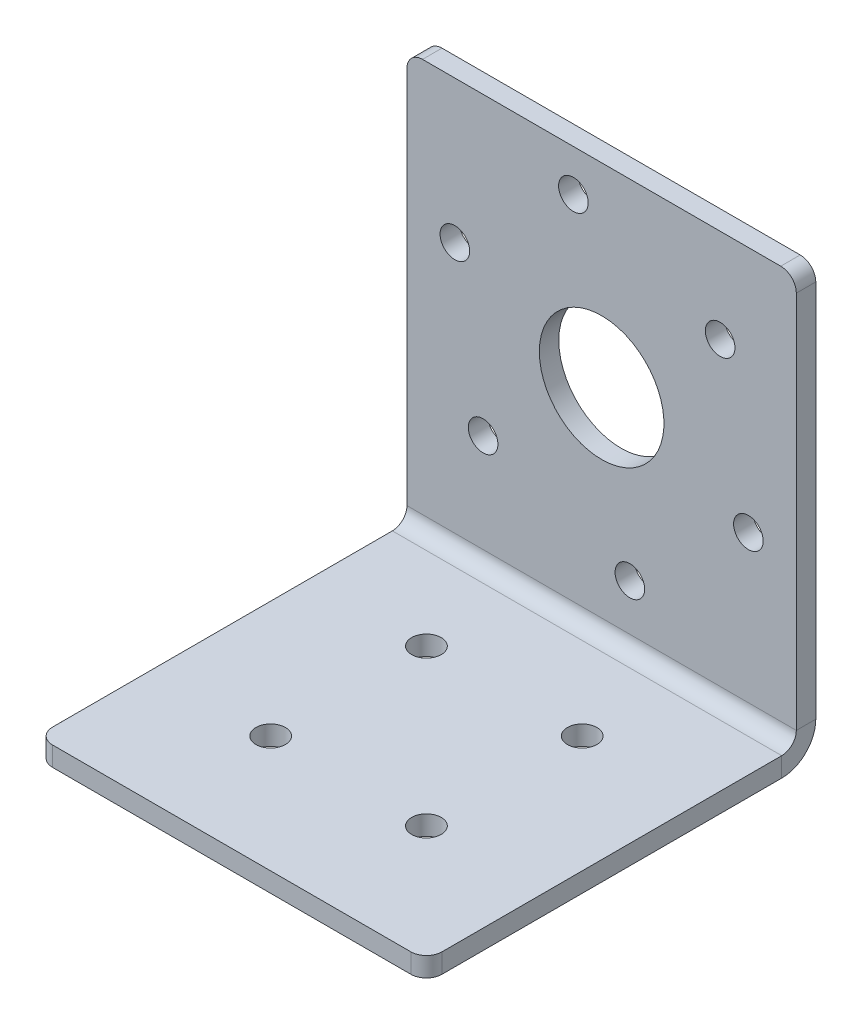
ISO-10303-21;
HEADER;
FILE_DESCRIPTION(('STEP AP214'),'2;1');
FILE_NAME('part.step','',(''),(''),'','','');
FILE_SCHEMA(('AUTOMOTIVE_DESIGN { 1 0 10303 214 1 1 1 1 }'));
ENDSEC;
DATA;
#1=APPLICATION_CONTEXT('core data for automotive mechanical design processes');
#2=APPLICATION_PROTOCOL_DEFINITION('international standard','automotive_design',2000,#1);
#3=PRODUCT_CONTEXT('',#1,'mechanical');
#4=PRODUCT('Part','Part','',(#3));
#5=PRODUCT_RELATED_PRODUCT_CATEGORY('part','',(#4));
#6=PRODUCT_DEFINITION_FORMATION('','',#4);
#7=PRODUCT_DEFINITION_CONTEXT('part definition',#1,'design');
#8=PRODUCT_DEFINITION('design','',#6,#7);
#9=PRODUCT_DEFINITION_SHAPE('','',#8);
#10=(LENGTH_UNIT() NAMED_UNIT(*) SI_UNIT(.MILLI.,.METRE.));
#11=(NAMED_UNIT(*) PLANE_ANGLE_UNIT() SI_UNIT($,.RADIAN.));
#12=(NAMED_UNIT(*) SI_UNIT($,.STERADIAN.) SOLID_ANGLE_UNIT());
#13=UNCERTAINTY_MEASURE_WITH_UNIT(LENGTH_MEASURE(1.E-05),#10,'distance_accuracy_value','');
#14=(GEOMETRIC_REPRESENTATION_CONTEXT(3) GLOBAL_UNCERTAINTY_ASSIGNED_CONTEXT((#13)) GLOBAL_UNIT_ASSIGNED_CONTEXT((#10,
#11,#12)) REPRESENTATION_CONTEXT('',''));
#15=CARTESIAN_POINT('',(0.,0.,0.));
#16=DIRECTION('',(0.,0.,1.));
#17=DIRECTION('',(1.,0.,0.));
#18=AXIS2_PLACEMENT_3D('',#15,#16,#17);
#19=CARTESIAN_POINT('',(63.5,69.85,-60.325));
#20=DIRECTION('',(1.,0.,0.));
#21=DIRECTION('',(0.,-1.,0.));
#22=AXIS2_PLACEMENT_3D('',#19,#20,#21);
#23=PLANE('',#22);
#24=DIRECTION('',(0.,0.,1.));
#25=VECTOR('',#24,1.);
#26=CARTESIAN_POINT('',(63.5,5.555000066,-60.325));
#27=LINE('',#26,#25);
#28=CARTESIAN_POINT('',(63.5,5.555000066,-63.5));
#29=VERTEX_POINT('',#28);
#30=CARTESIAN_POINT('',(63.5,5.555000066,-60.325));
#31=VERTEX_POINT('',#30);
#32=EDGE_CURVE('E12',#29,#31,#27,.T.);
#33=ORIENTED_EDGE('',*,*,#32,.F.);
#34=DIRECTION('',(0.,1.,0.));
#35=VECTOR('',#34,1.);
#36=CARTESIAN_POINT('',(63.5,69.85,-63.5));
#37=LINE('',#36,#35);
#38=CARTESIAN_POINT('',(63.5,67.31,-63.5));
#39=VERTEX_POINT('',#38);
#40=EDGE_CURVE('E112',#39,#29,#37,.F.);
#41=ORIENTED_EDGE('',*,*,#40,.F.);
#42=DIRECTION('',(0.,0.,1.));
#43=VECTOR('',#42,1.);
#44=CARTESIAN_POINT('',(63.5,67.31,-60.325));
#45=LINE('',#44,#43);
#46=CARTESIAN_POINT('',(63.5,67.31,-60.325));
#47=VERTEX_POINT('',#46);
#48=EDGE_CURVE('E61',#39,#47,#45,.T.);
#49=ORIENTED_EDGE('',*,*,#48,.T.);
#50=DIRECTION('',(0.,-1.,0.));
#51=VECTOR('',#50,1.);
#52=CARTESIAN_POINT('',(63.5,69.85,-60.325));
#53=LINE('',#52,#51);
#54=EDGE_CURVE('E115',#47,#31,#53,.T.);
#55=ORIENTED_EDGE('',*,*,#54,.T.);
#56=EDGE_LOOP('',(#33,#41,#49,#55));
#57=FACE_BOUND('',#56,.T.);
#58=ADVANCED_FACE('F51',(#57),#23,.T.);
#59=CARTESIAN_POINT('',(60.96,67.31,-60.325));
#60=DIRECTION('',(0.,0.,-1.));
#61=DIRECTION('',(-1.,0.,0.));
#62=AXIS2_PLACEMENT_3D('',#59,#60,#61);
#63=CYLINDRICAL_SURFACE('',#62,2.54);
#64=ORIENTED_EDGE('',*,*,#48,.F.);
#65=CARTESIAN_POINT('',(60.96,67.31,-63.5));
#66=DIRECTION('',(0.,0.,-1.));
#67=DIRECTION('',(-1.,0.,0.));
#68=AXIS2_PLACEMENT_3D('',#65,#66,#67);
#69=CIRCLE('',#68,2.54);
#70=CARTESIAN_POINT('',(60.96,69.85,-63.5));
#71=VERTEX_POINT('',#70);
#72=EDGE_CURVE('E140',#39,#71,#69,.F.);
#73=ORIENTED_EDGE('',*,*,#72,.T.);
#74=DIRECTION('',(0.,0.,1.));
#75=VECTOR('',#74,1.);
#76=CARTESIAN_POINT('',(60.96,69.85,-60.325));
#77=LINE('',#76,#75);
#78=CARTESIAN_POINT('',(60.96,69.85,-60.325));
#79=VERTEX_POINT('',#78);
#80=EDGE_CURVE('E192',#71,#79,#77,.T.);
#81=ORIENTED_EDGE('',*,*,#80,.T.);
#82=CARTESIAN_POINT('',(60.96,67.31,-60.325));
#83=DIRECTION('',(0.,0.,-1.));
#84=DIRECTION('',(-1.,0.,0.));
#85=AXIS2_PLACEMENT_3D('',#82,#83,#84);
#86=CIRCLE('',#85,2.54);
#87=EDGE_CURVE('E205',#47,#79,#86,.F.);
#88=ORIENTED_EDGE('',*,*,#87,.F.);
#89=EDGE_LOOP('',(#64,#73,#81,#88));
#90=FACE_BOUND('',#89,.T.);
#91=ADVANCED_FACE('F211',(#90),#63,.T.);
#92=CARTESIAN_POINT('',(0.,69.85,-60.325));
#93=DIRECTION('',(0.,1.,0.));
#94=DIRECTION('',(1.,0.,0.));
#95=AXIS2_PLACEMENT_3D('',#92,#93,#94);
#96=PLANE('',#95);
#97=ORIENTED_EDGE('',*,*,#80,.F.);
#98=DIRECTION('',(-1.,0.,0.));
#99=VECTOR('',#98,1.);
#100=CARTESIAN_POINT('',(0.,69.85,-63.5));
#101=LINE('',#100,#99);
#102=CARTESIAN_POINT('',(2.54,69.85,-63.5));
#103=VERTEX_POINT('',#102);
#104=EDGE_CURVE('E290',#103,#71,#101,.F.);
#105=ORIENTED_EDGE('',*,*,#104,.F.);
#106=DIRECTION('',(0.,0.,1.));
#107=VECTOR('',#106,1.);
#108=CARTESIAN_POINT('',(2.54,69.85,-60.325));
#109=LINE('',#108,#107);
#110=CARTESIAN_POINT('',(2.54,69.85,-60.325));
#111=VERTEX_POINT('',#110);
#112=EDGE_CURVE('E189',#103,#111,#109,.T.);
#113=ORIENTED_EDGE('',*,*,#112,.T.);
#114=DIRECTION('',(1.,0.,0.));
#115=VECTOR('',#114,1.);
#116=CARTESIAN_POINT('',(0.,69.85,-60.325));
#117=LINE('',#116,#115);
#118=EDGE_CURVE('E212',#111,#79,#117,.T.);
#119=ORIENTED_EDGE('',*,*,#118,.T.);
#120=EDGE_LOOP('',(#97,#105,#113,#119));
#121=FACE_BOUND('',#120,.T.);
#122=ADVANCED_FACE('F294',(#121),#96,.T.);
#123=CARTESIAN_POINT('',(2.54,67.31,-60.325));
#124=DIRECTION('',(0.,0.,-1.));
#125=DIRECTION('',(-1.,0.,0.));
#126=AXIS2_PLACEMENT_3D('',#123,#124,#125);
#127=CYLINDRICAL_SURFACE('',#126,2.54);
#128=ORIENTED_EDGE('',*,*,#112,.F.);
#129=CARTESIAN_POINT('',(2.54,67.31,-63.5));
#130=DIRECTION('',(0.,0.,-1.));
#131=DIRECTION('',(-1.,0.,0.));
#132=AXIS2_PLACEMENT_3D('',#129,#130,#131);
#133=CIRCLE('',#132,2.54);
#134=CARTESIAN_POINT('',(0.,67.31,-63.5));
#135=VERTEX_POINT('',#134);
#136=EDGE_CURVE('E287',#103,#135,#133,.F.);
#137=ORIENTED_EDGE('',*,*,#136,.T.);
#138=DIRECTION('',(0.,0.,1.));
#139=VECTOR('',#138,1.);
#140=CARTESIAN_POINT('',(0.,67.31,-60.325));
#141=LINE('',#140,#139);
#142=CARTESIAN_POINT('',(0.,67.31,-60.325));
#143=VERTEX_POINT('',#142);
#144=EDGE_CURVE('E186',#135,#143,#141,.T.);
#145=ORIENTED_EDGE('',*,*,#144,.T.);
#146=CARTESIAN_POINT('',(2.54,67.31,-60.325));
#147=DIRECTION('',(0.,0.,-1.));
#148=DIRECTION('',(-1.,0.,0.));
#149=AXIS2_PLACEMENT_3D('',#146,#147,#148);
#150=CIRCLE('',#149,2.54);
#151=EDGE_CURVE('E214',#111,#143,#150,.F.);
#152=ORIENTED_EDGE('',*,*,#151,.F.);
#153=EDGE_LOOP('',(#128,#137,#145,#152));
#154=FACE_BOUND('',#153,.T.);
#155=ADVANCED_FACE('F302',(#154),#127,.T.);
#156=CARTESIAN_POINT('',(0.,69.85,-60.325));
#157=DIRECTION('',(1.,0.,0.));
#158=DIRECTION('',(0.,-1.,0.));
#159=AXIS2_PLACEMENT_3D('',#156,#157,#158);
#160=PLANE('',#159);
#161=ORIENTED_EDGE('',*,*,#144,.F.);
#162=DIRECTION('',(0.,1.,0.));
#163=VECTOR('',#162,1.);
#164=CARTESIAN_POINT('',(0.,69.85,-63.5));
#165=LINE('',#164,#163);
#166=CARTESIAN_POINT('',(0.,5.555000066,-63.5));
#167=VERTEX_POINT('',#166);
#168=EDGE_CURVE('E264',#135,#167,#165,.F.);
#169=ORIENTED_EDGE('',*,*,#168,.T.);
#170=DIRECTION('',(0.,0.,1.));
#171=VECTOR('',#170,1.);
#172=CARTESIAN_POINT('',(0.,5.555000066,-60.325));
#173=LINE('',#172,#171);
#174=CARTESIAN_POINT('',(0.,5.555000066,-60.325));
#175=VERTEX_POINT('',#174);
#176=EDGE_CURVE('E183',#167,#175,#173,.T.);
#177=ORIENTED_EDGE('',*,*,#176,.T.);
#178=DIRECTION('',(0.,-1.,0.));
#179=VECTOR('',#178,1.);
#180=CARTESIAN_POINT('',(0.,69.85,-60.325));
#181=LINE('',#180,#179);
#182=EDGE_CURVE('E220',#143,#175,#181,.T.);
#183=ORIENTED_EDGE('',*,*,#182,.F.);
#184=EDGE_LOOP('',(#161,#169,#177,#183));
#185=FACE_BOUND('',#184,.T.);
#186=ADVANCED_FACE('F306',(#185),#160,.F.);
#187=CARTESIAN_POINT('',(0.,5.555000066,-57.944999934));
#188=DIRECTION('',(-1.,0.,0.));
#189=DIRECTION('',(0.,0.,1.));
#190=AXIS2_PLACEMENT_3D('',#187,#188,#189);
#191=PLANE('',#190);
#192=ORIENTED_EDGE('',*,*,#176,.F.);
#193=CARTESIAN_POINT('',(0.,5.555000066,-57.944999934));
#194=DIRECTION('',(-1.,0.,0.));
#195=DIRECTION('',(0.,0.,1.));
#196=AXIS2_PLACEMENT_3D('',#193,#194,#195);
#197=CIRCLE('',#196,5.555000066);
#198=CARTESIAN_POINT('',(0.,0.,-57.944999934));
#199=VERTEX_POINT('',#198);
#200=EDGE_CURVE('E129',#167,#199,#197,.T.);
#201=ORIENTED_EDGE('',*,*,#200,.T.);
#202=DIRECTION('',(0.,1.,0.));
#203=VECTOR('',#202,1.);
#204=CARTESIAN_POINT('',(0.,3.175,-57.944999934));
#205=LINE('',#204,#203);
#206=CARTESIAN_POINT('',(0.,3.175,-57.944999934));
#207=VERTEX_POINT('',#206);
#208=EDGE_CURVE('E181',#199,#207,#205,.T.);
#209=ORIENTED_EDGE('',*,*,#208,.T.);
#210=CARTESIAN_POINT('',(0.,5.555000066,-57.944999934));
#211=DIRECTION('',(1.,0.,0.));
#212=DIRECTION('',(0.,0.,-1.));
#213=AXIS2_PLACEMENT_3D('',#210,#211,#212);
#214=CIRCLE('',#213,2.380000066);
#215=EDGE_CURVE('E255',#175,#207,#214,.F.);
#216=ORIENTED_EDGE('',*,*,#215,.F.);
#217=EDGE_LOOP('',(#192,#201,#209,#216));
#218=FACE_BOUND('',#217,.T.);
#219=ADVANCED_FACE('F309',(#218),#191,.T.);
#220=CARTESIAN_POINT('',(0.,3.175,0.));
#221=DIRECTION('',(1.,0.,0.));
#222=DIRECTION('',(0.,0.,1.));
#223=AXIS2_PLACEMENT_3D('',#220,#221,#222);
#224=PLANE('',#223);
#225=ORIENTED_EDGE('',*,*,#208,.F.);
#226=DIRECTION('',(0.,0.,-1.));
#227=VECTOR('',#226,1.);
#228=CARTESIAN_POINT('',(0.,0.,0.));
#229=LINE('',#228,#227);
#230=CARTESIAN_POINT('',(0.,0.,-2.54));
#231=VERTEX_POINT('',#230);
#232=EDGE_CURVE('E273',#199,#231,#229,.F.);
#233=ORIENTED_EDGE('',*,*,#232,.T.);
#234=DIRECTION('',(0.,1.,0.));
#235=VECTOR('',#234,1.);
#236=CARTESIAN_POINT('',(0.,3.175,-2.54));
#237=LINE('',#236,#235);
#238=CARTESIAN_POINT('',(0.,3.175,-2.54));
#239=VERTEX_POINT('',#238);
#240=EDGE_CURVE('E178',#231,#239,#237,.T.);
#241=ORIENTED_EDGE('',*,*,#240,.T.);
#242=DIRECTION('',(0.,0.,1.));
#243=VECTOR('',#242,1.);
#244=CARTESIAN_POINT('',(0.,3.175,0.));
#245=LINE('',#244,#243);
#246=EDGE_CURVE('E234',#207,#239,#245,.T.);
#247=ORIENTED_EDGE('',*,*,#246,.F.);
#248=EDGE_LOOP('',(#225,#233,#241,#247));
#249=FACE_BOUND('',#248,.T.);
#250=ADVANCED_FACE('F328',(#249),#224,.F.);
#251=CARTESIAN_POINT('',(2.54,3.175,-2.54));
#252=DIRECTION('',(0.,-1.,0.));
#253=DIRECTION('',(0.,0.,-1.));
#254=AXIS2_PLACEMENT_3D('',#251,#252,#253);
#255=CYLINDRICAL_SURFACE('',#254,2.54);
#256=ORIENTED_EDGE('',*,*,#240,.F.);
#257=CARTESIAN_POINT('',(2.54,0.,-2.54));
#258=DIRECTION('',(0.,-1.,0.));
#259=DIRECTION('',(0.,0.,-1.));
#260=AXIS2_PLACEMENT_3D('',#257,#258,#259);
#261=CIRCLE('',#260,2.54);
#262=CARTESIAN_POINT('',(2.54,0.,0.));
#263=VERTEX_POINT('',#262);
#264=EDGE_CURVE('E281',#231,#263,#261,.F.);
#265=ORIENTED_EDGE('',*,*,#264,.T.);
#266=DIRECTION('',(0.,1.,0.));
#267=VECTOR('',#266,1.);
#268=CARTESIAN_POINT('',(2.54,3.175,0.));
#269=LINE('',#268,#267);
#270=CARTESIAN_POINT('',(2.54,3.175,0.));
#271=VERTEX_POINT('',#270);
#272=EDGE_CURVE('E175',#263,#271,#269,.T.);
#273=ORIENTED_EDGE('',*,*,#272,.T.);
#274=CARTESIAN_POINT('',(2.54,3.175,-2.54));
#275=DIRECTION('',(0.,-1.,0.));
#276=DIRECTION('',(0.,0.,-1.));
#277=AXIS2_PLACEMENT_3D('',#274,#275,#276);
#278=CIRCLE('',#277,2.54);
#279=EDGE_CURVE('E237',#239,#271,#278,.F.);
#280=ORIENTED_EDGE('',*,*,#279,.F.);
#281=EDGE_LOOP('',(#256,#265,#273,#280));
#282=FACE_BOUND('',#281,.T.);
#283=ADVANCED_FACE('F334',(#282),#255,.T.);
#284=CARTESIAN_POINT('',(0.,3.175,0.));
#285=DIRECTION('',(0.,0.,-1.));
#286=DIRECTION('',(1.,0.,0.));
#287=AXIS2_PLACEMENT_3D('',#284,#285,#286);
#288=PLANE('',#287);
#289=ORIENTED_EDGE('',*,*,#272,.F.);
#290=DIRECTION('',(1.,0.,0.));
#291=VECTOR('',#290,1.);
#292=CARTESIAN_POINT('',(0.,0.,0.));
#293=LINE('',#292,#291);
#294=CARTESIAN_POINT('',(60.96,0.,0.));
#295=VERTEX_POINT('',#294);
#296=EDGE_CURVE('E278',#263,#295,#293,.T.);
#297=ORIENTED_EDGE('',*,*,#296,.T.);
#298=DIRECTION('',(0.,1.,0.));
#299=VECTOR('',#298,1.);
#300=CARTESIAN_POINT('',(60.96,3.175,0.));
#301=LINE('',#300,#299);
#302=CARTESIAN_POINT('',(60.96,3.175,0.));
#303=VERTEX_POINT('',#302);
#304=EDGE_CURVE('E172',#295,#303,#301,.T.);
#305=ORIENTED_EDGE('',*,*,#304,.T.);
#306=DIRECTION('',(1.,0.,0.));
#307=VECTOR('',#306,1.);
#308=CARTESIAN_POINT('',(0.,3.175,0.));
#309=LINE('',#308,#307);
#310=EDGE_CURVE('E240',#271,#303,#309,.T.);
#311=ORIENTED_EDGE('',*,*,#310,.F.);
#312=EDGE_LOOP('',(#289,#297,#305,#311));
#313=FACE_BOUND('',#312,.T.);
#314=ADVANCED_FACE('F337',(#313),#288,.F.);
#315=CARTESIAN_POINT('',(60.96,3.175,-2.54));
#316=DIRECTION('',(0.,-1.,0.));
#317=DIRECTION('',(0.,0.,-1.));
#318=AXIS2_PLACEMENT_3D('',#315,#316,#317);
#319=CYLINDRICAL_SURFACE('',#318,2.54);
#320=ORIENTED_EDGE('',*,*,#304,.F.);
#321=CARTESIAN_POINT('',(60.96,0.,-2.54));
#322=DIRECTION('',(0.,-1.,0.));
#323=DIRECTION('',(0.,0.,-1.));
#324=AXIS2_PLACEMENT_3D('',#321,#322,#323);
#325=CIRCLE('',#324,2.54);
#326=CARTESIAN_POINT('',(63.5,0.,-2.54));
#327=VERTEX_POINT('',#326);
#328=EDGE_CURVE('E275',#295,#327,#325,.F.);
#329=ORIENTED_EDGE('',*,*,#328,.T.);
#330=DIRECTION('',(0.,1.,0.));
#331=VECTOR('',#330,1.);
#332=CARTESIAN_POINT('',(63.5,3.175,-2.54));
#333=LINE('',#332,#331);
#334=CARTESIAN_POINT('',(63.5,3.175,-2.54));
#335=VERTEX_POINT('',#334);
#336=EDGE_CURVE('E169',#327,#335,#333,.T.);
#337=ORIENTED_EDGE('',*,*,#336,.T.);
#338=CARTESIAN_POINT('',(60.96,3.175,-2.54));
#339=DIRECTION('',(0.,-1.,0.));
#340=DIRECTION('',(0.,0.,-1.));
#341=AXIS2_PLACEMENT_3D('',#338,#339,#340);
#342=CIRCLE('',#341,2.54);
#343=EDGE_CURVE('E243',#303,#335,#342,.F.);
#344=ORIENTED_EDGE('',*,*,#343,.F.);
#345=EDGE_LOOP('',(#320,#329,#337,#344));
#346=FACE_BOUND('',#345,.T.);
#347=ADVANCED_FACE('F342',(#346),#319,.T.);
#348=CARTESIAN_POINT('',(63.5,3.175,0.));
#349=DIRECTION('',(-1.,0.,0.));
#350=DIRECTION('',(0.,0.,-1.));
#351=AXIS2_PLACEMENT_3D('',#348,#349,#350);
#352=PLANE('',#351);
#353=ORIENTED_EDGE('',*,*,#336,.F.);
#354=DIRECTION('',(0.,0.,-1.));
#355=VECTOR('',#354,1.);
#356=CARTESIAN_POINT('',(63.5,0.,0.));
#357=LINE('',#356,#355);
#358=CARTESIAN_POINT('',(63.5,0.,-57.944999934));
#359=VERTEX_POINT('',#358);
#360=EDGE_CURVE('E134',#327,#359,#357,.T.);
#361=ORIENTED_EDGE('',*,*,#360,.T.);
#362=DIRECTION('',(0.,1.,0.));
#363=VECTOR('',#362,1.);
#364=CARTESIAN_POINT('',(63.5,3.175,-57.944999934));
#365=LINE('',#364,#363);
#366=CARTESIAN_POINT('',(63.5,3.175,-57.944999934));
#367=VERTEX_POINT('',#366);
#368=EDGE_CURVE('E55',#359,#367,#365,.T.);
#369=ORIENTED_EDGE('',*,*,#368,.T.);
#370=DIRECTION('',(0.,0.,-1.));
#371=VECTOR('',#370,1.);
#372=CARTESIAN_POINT('',(63.5,3.175,0.));
#373=LINE('',#372,#371);
#374=EDGE_CURVE('E246',#335,#367,#373,.T.);
#375=ORIENTED_EDGE('',*,*,#374,.F.);
#376=EDGE_LOOP('',(#353,#361,#369,#375));
#377=FACE_BOUND('',#376,.T.);
#378=ADVANCED_FACE('F319',(#377),#352,.F.);
#379=CARTESIAN_POINT('',(12.4205476931811,21.6217636405345,-60.325));
#380=DIRECTION('',(0.,0.,-1.));
#381=DIRECTION('',(-1.,0.,0.));
#382=AXIS2_PLACEMENT_3D('',#379,#380,#381);
#383=CYLINDRICAL_SURFACE('',#382,2.413);
#384=CARTESIAN_POINT('',(12.4205476931811,21.6217636405345,-60.325));
#385=DIRECTION('',(0.,0.,-1.));
#386=DIRECTION('',(-1.,0.,0.));
#387=AXIS2_PLACEMENT_3D('',#384,#385,#386);
#388=CIRCLE('',#387,2.413);
#389=CARTESIAN_POINT('',(10.0075476931811,21.6217636405345,-60.325));
#390=VERTEX_POINT('',#389);
#391=EDGE_CURVE('E258',#390,#390,#388,.T.);
#392=ORIENTED_EDGE('',*,*,#391,.F.);
#393=EDGE_LOOP('',(#392));
#394=FACE_BOUND('',#393,.T.);
#395=CARTESIAN_POINT('',(12.4205476931811,21.6217636405345,-63.5));
#396=DIRECTION('',(0.,0.,-1.));
#397=DIRECTION('',(-1.,0.,0.));
#398=AXIS2_PLACEMENT_3D('',#395,#396,#397);
#399=CIRCLE('',#398,2.413);
#400=CARTESIAN_POINT('',(10.0075476931811,21.6217636405345,-63.5));
#401=VERTEX_POINT('',#400);
#402=EDGE_CURVE('E146',#401,#401,#399,.T.);
#403=ORIENTED_EDGE('',*,*,#402,.T.);
#404=EDGE_LOOP('',(#403));
#405=FACE_BOUND('',#404,.T.);
#406=ADVANCED_FACE('F349',(#394,#405),#383,.F.);
#407=CARTESIAN_POINT('',(36.3558451434521,13.1210850813223,-60.325));
#408=DIRECTION('',(0.,0.,-1.));
#409=DIRECTION('',(-1.,0.,0.));
#410=AXIS2_PLACEMENT_3D('',#407,#408,#409);
#411=CYLINDRICAL_SURFACE('',#410,2.413);
#412=CARTESIAN_POINT('',(36.3558451434521,13.1210850813223,-60.325));
#413=DIRECTION('',(0.,0.,-1.));
#414=DIRECTION('',(-1.,0.,0.));
#415=AXIS2_PLACEMENT_3D('',#412,#413,#414);
#416=CIRCLE('',#415,2.413);
#417=CARTESIAN_POINT('',(33.9428451434521,13.1210850813223,-60.325));
#418=VERTEX_POINT('',#417);
#419=EDGE_CURVE('E754',#418,#418,#416,.T.);
#420=ORIENTED_EDGE('',*,*,#419,.F.);
#421=EDGE_LOOP('',(#420));
#422=FACE_BOUND('',#421,.T.);
#423=CARTESIAN_POINT('',(36.3558451434521,13.1210850813223,-63.5));
#424=DIRECTION('',(0.,0.,-1.));
#425=DIRECTION('',(-1.,0.,0.));
#426=AXIS2_PLACEMENT_3D('',#423,#424,#425);
#427=CIRCLE('',#426,2.413);
#428=CARTESIAN_POINT('',(33.9428451434521,13.1210850813223,-63.5));
#429=VERTEX_POINT('',#428);
#430=EDGE_CURVE('E152',#429,#429,#427,.T.);
#431=ORIENTED_EDGE('',*,*,#430,.T.);
#432=EDGE_LOOP('',(#431));
#433=FACE_BOUND('',#432,.T.);
#434=ADVANCED_FACE('F365',(#422,#433),#411,.F.);
#435=CARTESIAN_POINT('',(27.1441548565479,63.0789149186777,-60.325));
#436=DIRECTION('',(0.,0.,-1.));
#437=DIRECTION('',(-1.,0.,0.));
#438=AXIS2_PLACEMENT_3D('',#435,#436,#437);
#439=CYLINDRICAL_SURFACE('',#438,2.413);
#440=CARTESIAN_POINT('',(27.1441548565479,63.0789149186777,-60.325));
#441=DIRECTION('',(0.,0.,-1.));
#442=DIRECTION('',(-1.,0.,0.));
#443=AXIS2_PLACEMENT_3D('',#440,#441,#442);
#444=CIRCLE('',#443,2.413);
#445=CARTESIAN_POINT('',(24.7311548565479,63.0789149186777,-60.325));
#446=VERTEX_POINT('',#445);
#447=EDGE_CURVE('E758',#446,#446,#444,.T.);
#448=ORIENTED_EDGE('',*,*,#447,.F.);
#449=EDGE_LOOP('',(#448));
#450=FACE_BOUND('',#449,.T.);
#451=CARTESIAN_POINT('',(27.1441548565479,63.0789149186777,-63.5));
#452=DIRECTION('',(0.,0.,-1.));
#453=DIRECTION('',(-1.,0.,0.));
#454=AXIS2_PLACEMENT_3D('',#451,#452,#453);
#455=CIRCLE('',#454,2.413);
#456=CARTESIAN_POINT('',(24.7311548565479,63.0789149186777,-63.5));
#457=VERTEX_POINT('',#456);
#458=EDGE_CURVE('E155',#457,#457,#455,.T.);
#459=ORIENTED_EDGE('',*,*,#458,.T.);
#460=EDGE_LOOP('',(#459));
#461=FACE_BOUND('',#460,.T.);
#462=ADVANCED_FACE('F369',(#450,#461),#439,.F.);
#463=CARTESIAN_POINT('',(7.81470254972898,46.6006785592121,-60.325));
#464=DIRECTION('',(0.,0.,-1.));
#465=DIRECTION('',(-1.,0.,0.));
#466=AXIS2_PLACEMENT_3D('',#463,#464,#465);
#467=CYLINDRICAL_SURFACE('',#466,2.41299999999999);
#468=CARTESIAN_POINT('',(7.81470254972898,46.6006785592121,-60.325));
#469=DIRECTION('',(0.,0.,-1.));
#470=DIRECTION('',(-1.,0.,0.));
#471=AXIS2_PLACEMENT_3D('',#468,#469,#470);
#472=CIRCLE('',#471,2.41299999999999);
#473=CARTESIAN_POINT('',(5.40170254972898,46.6006785592121,-60.325));
#474=VERTEX_POINT('',#473);
#475=EDGE_CURVE('E762',#474,#474,#472,.T.);
#476=ORIENTED_EDGE('',*,*,#475,.F.);
#477=EDGE_LOOP('',(#476));
#478=FACE_BOUND('',#477,.T.);
#479=CARTESIAN_POINT('',(7.81470254972898,46.6006785592121,-63.5));
#480=DIRECTION('',(0.,0.,-1.));
#481=DIRECTION('',(-1.,0.,0.));
#482=AXIS2_PLACEMENT_3D('',#479,#480,#481);
#483=CIRCLE('',#482,2.41299999999999);
#484=CARTESIAN_POINT('',(5.40170254972898,46.6006785592121,-63.5));
#485=VERTEX_POINT('',#484);
#486=EDGE_CURVE('E158',#485,#485,#483,.T.);
#487=ORIENTED_EDGE('',*,*,#486,.T.);
#488=EDGE_LOOP('',(#487));
#489=FACE_BOUND('',#488,.T.);
#490=ADVANCED_FACE('F373',(#478,#489),#467,.F.);
#491=CARTESIAN_POINT('',(31.75,38.1,-60.325));
#492=DIRECTION('',(0.,0.,-1.));
#493=DIRECTION('',(-1.,0.,0.));
#494=AXIS2_PLACEMENT_3D('',#491,#492,#493);
#495=CYLINDRICAL_SURFACE('',#494,10.16);
#496=CARTESIAN_POINT('',(31.75,38.1,-60.325));
#497=DIRECTION('',(0.,0.,-1.));
#498=DIRECTION('',(-1.,0.,0.));
#499=AXIS2_PLACEMENT_3D('',#496,#497,#498);
#500=CIRCLE('',#499,10.16);
#501=CARTESIAN_POINT('',(21.59,38.1,-60.325));
#502=VERTEX_POINT('',#501);
#503=EDGE_CURVE('E766',#502,#502,#500,.T.);
#504=ORIENTED_EDGE('',*,*,#503,.F.);
#505=EDGE_LOOP('',(#504));
#506=FACE_BOUND('',#505,.T.);
#507=CARTESIAN_POINT('',(31.75,38.1,-63.5));
#508=DIRECTION('',(0.,0.,-1.));
#509=DIRECTION('',(-1.,0.,0.));
#510=AXIS2_PLACEMENT_3D('',#507,#508,#509);
#511=CIRCLE('',#510,10.16);
#512=CARTESIAN_POINT('',(21.59,38.1,-63.5));
#513=VERTEX_POINT('',#512);
#514=EDGE_CURVE('E161',#513,#513,#511,.T.);
#515=ORIENTED_EDGE('',*,*,#514,.T.);
#516=EDGE_LOOP('',(#515));
#517=FACE_BOUND('',#516,.T.);
#518=ADVANCED_FACE('F377',(#506,#517),#495,.F.);
#519=CARTESIAN_POINT('',(55.685297450271,29.5993214407878,-60.325));
#520=DIRECTION('',(0.,0.,-1.));
#521=DIRECTION('',(-1.,0.,0.));
#522=AXIS2_PLACEMENT_3D('',#519,#520,#521);
#523=CYLINDRICAL_SURFACE('',#522,2.41299999999999);
#524=CARTESIAN_POINT('',(55.685297450271,29.5993214407878,-60.325));
#525=DIRECTION('',(0.,0.,-1.));
#526=DIRECTION('',(-1.,0.,0.));
#527=AXIS2_PLACEMENT_3D('',#524,#525,#526);
#528=CIRCLE('',#527,2.41299999999999);
#529=CARTESIAN_POINT('',(53.272297450271,29.5993214407878,-60.325));
#530=VERTEX_POINT('',#529);
#531=EDGE_CURVE('E392',#530,#530,#528,.T.);
#532=ORIENTED_EDGE('',*,*,#531,.F.);
#533=EDGE_LOOP('',(#532));
#534=FACE_BOUND('',#533,.T.);
#535=CARTESIAN_POINT('',(55.685297450271,29.5993214407878,-63.5));
#536=DIRECTION('',(0.,0.,-1.));
#537=DIRECTION('',(-1.,0.,0.));
#538=AXIS2_PLACEMENT_3D('',#535,#536,#537);
#539=CIRCLE('',#538,2.41299999999999);
#540=CARTESIAN_POINT('',(53.272297450271,29.5993214407878,-63.5));
#541=VERTEX_POINT('',#540);
#542=EDGE_CURVE('E164',#541,#541,#539,.T.);
#543=ORIENTED_EDGE('',*,*,#542,.T.);
#544=EDGE_LOOP('',(#543));
#545=FACE_BOUND('',#544,.T.);
#546=ADVANCED_FACE('F380',(#534,#545),#523,.F.);
#547=CARTESIAN_POINT('',(51.0794523068189,54.5782363594655,-60.325));
#548=DIRECTION('',(0.,0.,-1.));
#549=DIRECTION('',(-1.,0.,0.));
#550=AXIS2_PLACEMENT_3D('',#547,#548,#549);
#551=CYLINDRICAL_SURFACE('',#550,2.41299999999999);
#552=CARTESIAN_POINT('',(51.0794523068189,54.5782363594655,-60.325));
#553=DIRECTION('',(0.,0.,-1.));
#554=DIRECTION('',(-1.,0.,0.));
#555=AXIS2_PLACEMENT_3D('',#552,#553,#554);
#556=CIRCLE('',#555,2.41299999999999);
#557=CARTESIAN_POINT('',(48.666452306819,54.5782363594655,-60.325));
#558=VERTEX_POINT('',#557);
#559=EDGE_CURVE('E209',#558,#558,#556,.T.);
#560=ORIENTED_EDGE('',*,*,#559,.F.);
#561=EDGE_LOOP('',(#560));
#562=FACE_BOUND('',#561,.T.);
#563=CARTESIAN_POINT('',(51.0794523068189,54.5782363594655,-63.5));
#564=DIRECTION('',(0.,0.,-1.));
#565=DIRECTION('',(-1.,0.,0.));
#566=AXIS2_PLACEMENT_3D('',#563,#564,#565);
#567=CIRCLE('',#566,2.41299999999999);
#568=CARTESIAN_POINT('',(48.666452306819,54.5782363594655,-63.5));
#569=VERTEX_POINT('',#568);
#570=EDGE_CURVE('E141',#569,#569,#567,.T.);
#571=ORIENTED_EDGE('',*,*,#570,.T.);
#572=EDGE_LOOP('',(#571));
#573=FACE_BOUND('',#572,.T.);
#574=ADVANCED_FACE('F53',(#562,#573),#551,.F.);
#575=CARTESIAN_POINT('',(44.45,3.175,-19.05));
#576=DIRECTION('',(0.,-1.,0.));
#577=DIRECTION('',(0.,0.,-1.));
#578=AXIS2_PLACEMENT_3D('',#575,#576,#577);
#579=CYLINDRICAL_SURFACE('',#578,2.413);
#580=CARTESIAN_POINT('',(44.45,3.175,-19.05));
#581=DIRECTION('',(0.,1.,0.));
#582=DIRECTION('',(0.,0.,1.));
#583=AXIS2_PLACEMENT_3D('',#580,#581,#582);
#584=CIRCLE('',#583,2.413);
#585=CARTESIAN_POINT('',(44.45,3.175,-16.637));
#586=VERTEX_POINT('',#585);
#587=EDGE_CURVE('E222',#586,#586,#584,.T.);
#588=ORIENTED_EDGE('',*,*,#587,.T.);
#589=EDGE_LOOP('',(#588));
#590=FACE_BOUND('',#589,.T.);
#591=CARTESIAN_POINT('',(44.45,0.,-19.05));
#592=DIRECTION('',(0.,1.,0.));
#593=DIRECTION('',(0.,0.,1.));
#594=AXIS2_PLACEMENT_3D('',#591,#592,#593);
#595=CIRCLE('',#594,2.413);
#596=CARTESIAN_POINT('',(44.45,0.,-16.637));
#597=VERTEX_POINT('',#596);
#598=EDGE_CURVE('E260',#597,#597,#595,.T.);
#599=ORIENTED_EDGE('',*,*,#598,.F.);
#600=EDGE_LOOP('',(#599));
#601=FACE_BOUND('',#600,.T.);
#602=ADVANCED_FACE('F387',(#590,#601),#579,.F.);
#603=CARTESIAN_POINT('',(19.05,3.175,-19.05));
#604=DIRECTION('',(0.,-1.,0.));
#605=DIRECTION('',(0.,0.,-1.));
#606=AXIS2_PLACEMENT_3D('',#603,#604,#605);
#607=CYLINDRICAL_SURFACE('',#606,2.413);
#608=CARTESIAN_POINT('',(19.05,3.175,-19.05));
#609=DIRECTION('',(0.,1.,0.));
#610=DIRECTION('',(0.,0.,1.));
#611=AXIS2_PLACEMENT_3D('',#608,#609,#610);
#612=CIRCLE('',#611,2.413);
#613=CARTESIAN_POINT('',(19.05,3.175,-16.637));
#614=VERTEX_POINT('',#613);
#615=EDGE_CURVE('E225',#614,#614,#612,.T.);
#616=ORIENTED_EDGE('',*,*,#615,.T.);
#617=EDGE_LOOP('',(#616));
#618=FACE_BOUND('',#617,.T.);
#619=CARTESIAN_POINT('',(19.05,0.,-19.05));
#620=DIRECTION('',(0.,1.,0.));
#621=DIRECTION('',(0.,0.,1.));
#622=AXIS2_PLACEMENT_3D('',#619,#620,#621);
#623=CIRCLE('',#622,2.413);
#624=CARTESIAN_POINT('',(19.05,0.,-16.637));
#625=VERTEX_POINT('',#624);
#626=EDGE_CURVE('E263',#625,#625,#623,.T.);
#627=ORIENTED_EDGE('',*,*,#626,.F.);
#628=EDGE_LOOP('',(#627));
#629=FACE_BOUND('',#628,.T.);
#630=ADVANCED_FACE('F414',(#618,#629),#607,.F.);
#631=CARTESIAN_POINT('',(44.45,3.175,-44.45));
#632=DIRECTION('',(0.,-1.,0.));
#633=DIRECTION('',(0.,0.,-1.));
#634=AXIS2_PLACEMENT_3D('',#631,#632,#633);
#635=CYLINDRICAL_SURFACE('',#634,2.41299999999999);
#636=CARTESIAN_POINT('',(44.45,3.175,-44.45));
#637=DIRECTION('',(0.,1.,0.));
#638=DIRECTION('',(0.,0.,1.));
#639=AXIS2_PLACEMENT_3D('',#636,#637,#638);
#640=CIRCLE('',#639,2.41299999999999);
#641=CARTESIAN_POINT('',(44.45,3.175,-42.037));
#642=VERTEX_POINT('',#641);
#643=EDGE_CURVE('E228',#642,#642,#640,.T.);
#644=ORIENTED_EDGE('',*,*,#643,.T.);
#645=EDGE_LOOP('',(#644));
#646=FACE_BOUND('',#645,.T.);
#647=CARTESIAN_POINT('',(44.45,0.,-44.45));
#648=DIRECTION('',(0.,1.,0.));
#649=DIRECTION('',(0.,0.,1.));
#650=AXIS2_PLACEMENT_3D('',#647,#648,#649);
#651=CIRCLE('',#650,2.41299999999999);
#652=CARTESIAN_POINT('',(44.45,0.,-42.037));
#653=VERTEX_POINT('',#652);
#654=EDGE_CURVE('E267',#653,#653,#651,.T.);
#655=ORIENTED_EDGE('',*,*,#654,.F.);
#656=EDGE_LOOP('',(#655));
#657=FACE_BOUND('',#656,.T.);
#658=ADVANCED_FACE('F418',(#646,#657),#635,.F.);
#659=CARTESIAN_POINT('',(19.05,3.175,-44.45));
#660=DIRECTION('',(0.,-1.,0.));
#661=DIRECTION('',(0.,0.,-1.));
#662=AXIS2_PLACEMENT_3D('',#659,#660,#661);
#663=CYLINDRICAL_SURFACE('',#662,2.413);
#664=CARTESIAN_POINT('',(19.05,3.175,-44.45));
#665=DIRECTION('',(0.,1.,0.));
#666=DIRECTION('',(0.,0.,1.));
#667=AXIS2_PLACEMENT_3D('',#664,#665,#666);
#668=CIRCLE('',#667,2.413);
#669=CARTESIAN_POINT('',(19.05,3.175,-42.037));
#670=VERTEX_POINT('',#669);
#671=EDGE_CURVE('E231',#670,#670,#668,.T.);
#672=ORIENTED_EDGE('',*,*,#671,.T.);
#673=EDGE_LOOP('',(#672));
#674=FACE_BOUND('',#673,.T.);
#675=CARTESIAN_POINT('',(19.05,0.,-44.45));
#676=DIRECTION('',(0.,1.,0.));
#677=DIRECTION('',(0.,0.,1.));
#678=AXIS2_PLACEMENT_3D('',#675,#676,#677);
#679=CIRCLE('',#678,2.413);
#680=CARTESIAN_POINT('',(19.05,0.,-42.037));
#681=VERTEX_POINT('',#680);
#682=EDGE_CURVE('E270',#681,#681,#679,.T.);
#683=ORIENTED_EDGE('',*,*,#682,.F.);
#684=EDGE_LOOP('',(#683));
#685=FACE_BOUND('',#684,.T.);
#686=ADVANCED_FACE('F362',(#674,#685),#663,.F.);
#687=CARTESIAN_POINT('',(63.5,5.555000066,-57.944999934));
#688=DIRECTION('',(-1.,0.,0.));
#689=DIRECTION('',(0.,0.,1.));
#690=AXIS2_PLACEMENT_3D('',#687,#688,#689);
#691=PLANE('',#690);
#692=CARTESIAN_POINT('',(63.5,5.555000066,-57.944999934));
#693=DIRECTION('',(-1.,0.,0.));
#694=DIRECTION('',(0.,0.,1.));
#695=AXIS2_PLACEMENT_3D('',#692,#693,#694);
#696=CIRCLE('',#695,5.555000066);
#697=EDGE_CURVE('E127',#359,#29,#696,.F.);
#698=ORIENTED_EDGE('',*,*,#697,.T.);
#699=ORIENTED_EDGE('',*,*,#32,.T.);
#700=CARTESIAN_POINT('',(63.5,5.555000066,-57.944999934));
#701=DIRECTION('',(1.,0.,0.));
#702=DIRECTION('',(0.,0.,-1.));
#703=AXIS2_PLACEMENT_3D('',#700,#701,#702);
#704=CIRCLE('',#703,2.380000066);
#705=EDGE_CURVE('E253',#367,#31,#704,.T.);
#706=ORIENTED_EDGE('',*,*,#705,.F.);
#707=ORIENTED_EDGE('',*,*,#368,.F.);
#708=EDGE_LOOP('',(#698,#699,#706,#707));
#709=FACE_BOUND('',#708,.T.);
#710=ADVANCED_FACE('F143',(#709),#691,.F.);
#711=CARTESIAN_POINT('',(0.,3.175,0.));
#712=DIRECTION('',(0.,-1.,0.));
#713=DIRECTION('',(0.,0.,-1.));
#714=AXIS2_PLACEMENT_3D('',#711,#712,#713);
#715=PLANE('',#714);
#716=ORIENTED_EDGE('',*,*,#587,.F.);
#717=EDGE_LOOP('',(#716));
#718=FACE_BOUND('',#717,.T.);
#719=ORIENTED_EDGE('',*,*,#615,.F.);
#720=EDGE_LOOP('',(#719));
#721=FACE_BOUND('',#720,.T.);
#722=ORIENTED_EDGE('',*,*,#643,.F.);
#723=EDGE_LOOP('',(#722));
#724=FACE_BOUND('',#723,.T.);
#725=ORIENTED_EDGE('',*,*,#671,.F.);
#726=EDGE_LOOP('',(#725));
#727=FACE_BOUND('',#726,.T.);
#728=ORIENTED_EDGE('',*,*,#374,.T.);
#729=DIRECTION('',(1.,0.,0.));
#730=VECTOR('',#729,1.);
#731=CARTESIAN_POINT('',(0.,3.175,-57.944999934));
#732=LINE('',#731,#730);
#733=EDGE_CURVE('E250',#367,#207,#732,.F.);
#734=ORIENTED_EDGE('',*,*,#733,.T.);
#735=ORIENTED_EDGE('',*,*,#246,.T.);
#736=ORIENTED_EDGE('',*,*,#279,.T.);
#737=ORIENTED_EDGE('',*,*,#310,.T.);
#738=ORIENTED_EDGE('',*,*,#343,.T.);
#739=EDGE_LOOP('',(#728,#734,#735,#736,#737,#738));
#740=FACE_BOUND('',#739,.T.);
#741=ADVANCED_FACE('F317',(#718,#721,#724,#727,#740),#715,.F.);
#742=CARTESIAN_POINT('',(0.,69.85,-60.325));
#743=DIRECTION('',(0.,0.,-1.));
#744=DIRECTION('',(-1.,0.,0.));
#745=AXIS2_PLACEMENT_3D('',#742,#743,#744);
#746=PLANE('',#745);
#747=ORIENTED_EDGE('',*,*,#391,.T.);
#748=EDGE_LOOP('',(#747));
#749=FACE_BOUND('',#748,.T.);
#750=ORIENTED_EDGE('',*,*,#419,.T.);
#751=EDGE_LOOP('',(#750));
#752=FACE_BOUND('',#751,.T.);
#753=ORIENTED_EDGE('',*,*,#447,.T.);
#754=EDGE_LOOP('',(#753));
#755=FACE_BOUND('',#754,.T.);
#756=ORIENTED_EDGE('',*,*,#475,.T.);
#757=EDGE_LOOP('',(#756));
#758=FACE_BOUND('',#757,.T.);
#759=ORIENTED_EDGE('',*,*,#503,.T.);
#760=EDGE_LOOP('',(#759));
#761=FACE_BOUND('',#760,.T.);
#762=ORIENTED_EDGE('',*,*,#531,.T.);
#763=EDGE_LOOP('',(#762));
#764=FACE_BOUND('',#763,.T.);
#765=ORIENTED_EDGE('',*,*,#559,.T.);
#766=EDGE_LOOP('',(#765));
#767=FACE_BOUND('',#766,.T.);
#768=ORIENTED_EDGE('',*,*,#182,.T.);
#769=DIRECTION('',(1.,0.,0.));
#770=VECTOR('',#769,1.);
#771=CARTESIAN_POINT('',(63.5,5.555000066,-60.325));
#772=LINE('',#771,#770);
#773=EDGE_CURVE('E208',#175,#31,#772,.T.);
#774=ORIENTED_EDGE('',*,*,#773,.T.);
#775=ORIENTED_EDGE('',*,*,#54,.F.);
#776=ORIENTED_EDGE('',*,*,#87,.T.);
#777=ORIENTED_EDGE('',*,*,#118,.F.);
#778=ORIENTED_EDGE('',*,*,#151,.T.);
#779=EDGE_LOOP('',(#768,#774,#775,#776,#777,#778));
#780=FACE_BOUND('',#779,.T.);
#781=ADVANCED_FACE('F203',(#749,#752,#755,#758,#761,#764,#767,#780),#746,.F.);
#782=CARTESIAN_POINT('',(0.,5.555000066,-57.944999934));
#783=DIRECTION('',(-1.,0.,0.));
#784=DIRECTION('',(0.,0.,1.));
#785=AXIS2_PLACEMENT_3D('',#782,#783,#784);
#786=CYLINDRICAL_SURFACE('',#785,2.380000066);
#787=ORIENTED_EDGE('',*,*,#215,.T.);
#788=ORIENTED_EDGE('',*,*,#733,.F.);
#789=ORIENTED_EDGE('',*,*,#705,.T.);
#790=ORIENTED_EDGE('',*,*,#773,.F.);
#791=EDGE_LOOP('',(#787,#788,#789,#790));
#792=FACE_BOUND('',#791,.T.);
#793=ADVANCED_FACE('F313',(#792),#786,.F.);
#794=CARTESIAN_POINT('',(0.,0.,0.));
#795=DIRECTION('',(0.,-1.,0.));
#796=DIRECTION('',(0.,0.,-1.));
#797=AXIS2_PLACEMENT_3D('',#794,#795,#796);
#798=PLANE('',#797);
#799=ORIENTED_EDGE('',*,*,#598,.T.);
#800=EDGE_LOOP('',(#799));
#801=FACE_BOUND('',#800,.T.);
#802=ORIENTED_EDGE('',*,*,#626,.T.);
#803=EDGE_LOOP('',(#802));
#804=FACE_BOUND('',#803,.T.);
#805=ORIENTED_EDGE('',*,*,#654,.T.);
#806=EDGE_LOOP('',(#805));
#807=FACE_BOUND('',#806,.T.);
#808=ORIENTED_EDGE('',*,*,#682,.T.);
#809=EDGE_LOOP('',(#808));
#810=FACE_BOUND('',#809,.T.);
#811=ORIENTED_EDGE('',*,*,#360,.F.);
#812=ORIENTED_EDGE('',*,*,#328,.F.);
#813=ORIENTED_EDGE('',*,*,#296,.F.);
#814=ORIENTED_EDGE('',*,*,#264,.F.);
#815=ORIENTED_EDGE('',*,*,#232,.F.);
#816=DIRECTION('',(1.,0.,0.));
#817=VECTOR('',#816,1.);
#818=CARTESIAN_POINT('',(0.,0.,-57.944999934));
#819=LINE('',#818,#817);
#820=EDGE_CURVE('E133',#359,#199,#819,.F.);
#821=ORIENTED_EDGE('',*,*,#820,.F.);
#822=EDGE_LOOP('',(#811,#812,#813,#814,#815,#821));
#823=FACE_BOUND('',#822,.T.);
#824=ADVANCED_FACE('F341',(#801,#804,#807,#810,#823),#798,.T.);
#825=CARTESIAN_POINT('',(0.,69.85,-63.5));
#826=DIRECTION('',(0.,0.,-1.));
#827=DIRECTION('',(-1.,0.,0.));
#828=AXIS2_PLACEMENT_3D('',#825,#826,#827);
#829=PLANE('',#828);
#830=ORIENTED_EDGE('',*,*,#402,.F.);
#831=EDGE_LOOP('',(#830));
#832=FACE_BOUND('',#831,.T.);
#833=ORIENTED_EDGE('',*,*,#430,.F.);
#834=EDGE_LOOP('',(#833));
#835=FACE_BOUND('',#834,.T.);
#836=ORIENTED_EDGE('',*,*,#458,.F.);
#837=EDGE_LOOP('',(#836));
#838=FACE_BOUND('',#837,.T.);
#839=ORIENTED_EDGE('',*,*,#486,.F.);
#840=EDGE_LOOP('',(#839));
#841=FACE_BOUND('',#840,.T.);
#842=ORIENTED_EDGE('',*,*,#514,.F.);
#843=EDGE_LOOP('',(#842));
#844=FACE_BOUND('',#843,.T.);
#845=ORIENTED_EDGE('',*,*,#542,.F.);
#846=EDGE_LOOP('',(#845));
#847=FACE_BOUND('',#846,.T.);
#848=ORIENTED_EDGE('',*,*,#570,.F.);
#849=EDGE_LOOP('',(#848));
#850=FACE_BOUND('',#849,.T.);
#851=ORIENTED_EDGE('',*,*,#168,.F.);
#852=ORIENTED_EDGE('',*,*,#136,.F.);
#853=ORIENTED_EDGE('',*,*,#104,.T.);
#854=ORIENTED_EDGE('',*,*,#72,.F.);
#855=ORIENTED_EDGE('',*,*,#40,.T.);
#856=DIRECTION('',(-1.,0.,0.));
#857=VECTOR('',#856,1.);
#858=CARTESIAN_POINT('',(0.,5.555000066,-63.5));
#859=LINE('',#858,#857);
#860=EDGE_CURVE('E124',#167,#29,#859,.F.);
#861=ORIENTED_EDGE('',*,*,#860,.F.);
#862=EDGE_LOOP('',(#851,#852,#853,#854,#855,#861));
#863=FACE_BOUND('',#862,.T.);
#864=ADVANCED_FACE('F137',(#832,#835,#838,#841,#844,#847,#850,#863),#829,.T.);
#865=CARTESIAN_POINT('',(0.,5.555000066,-57.944999934));
#866=DIRECTION('',(-1.,0.,0.));
#867=DIRECTION('',(0.,0.,1.));
#868=AXIS2_PLACEMENT_3D('',#865,#866,#867);
#869=CYLINDRICAL_SURFACE('',#868,5.555000066);
#870=ORIENTED_EDGE('',*,*,#200,.F.);
#871=ORIENTED_EDGE('',*,*,#860,.T.);
#872=ORIENTED_EDGE('',*,*,#697,.F.);
#873=ORIENTED_EDGE('',*,*,#820,.T.);
#874=EDGE_LOOP('',(#870,#871,#872,#873));
#875=FACE_BOUND('',#874,.T.);
#876=ADVANCED_FACE('F125',(#875),#869,.T.);
#877=CLOSED_SHELL('',(#58,#91,#122,#155,#186,#219,#250,#283,#314,#347,#378,#406,#434,#462,#490,
#518,#546,#574,#602,#630,#658,#686,#710,#741,#781,#793,#824,#864,#876));
#878=MANIFOLD_SOLID_BREP('B2',#877);
#879=ADVANCED_BREP_SHAPE_REPRESENTATION('',(#18,#878),#14);
#880=SHAPE_DEFINITION_REPRESENTATION(#9,#879);
ENDSEC;
END-ISO-10303-21;
